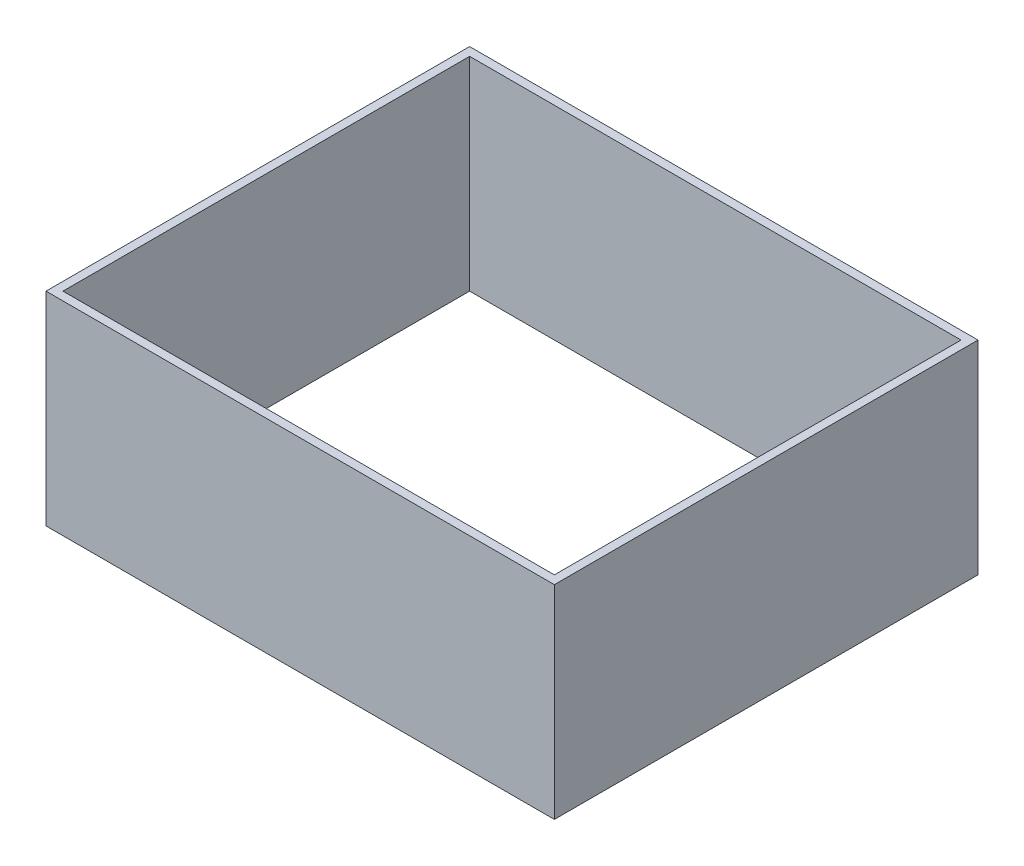
ISO-10303-21;
HEADER;
FILE_DESCRIPTION(('STEP AP214'),'2;1');
FILE_NAME('part.step','',(''),(''),'','','');
FILE_SCHEMA(('AUTOMOTIVE_DESIGN { 1 0 10303 214 1 1 1 1 }'));
ENDSEC;
DATA;
#1=APPLICATION_CONTEXT('core data for automotive mechanical design processes');
#2=APPLICATION_PROTOCOL_DEFINITION('international standard','automotive_design',2000,#1);
#3=PRODUCT_CONTEXT('',#1,'mechanical');
#4=PRODUCT('Part','Part','',(#3));
#5=PRODUCT_RELATED_PRODUCT_CATEGORY('part','',(#4));
#6=PRODUCT_DEFINITION_FORMATION('','',#4);
#7=PRODUCT_DEFINITION_CONTEXT('part definition',#1,'design');
#8=PRODUCT_DEFINITION('design','',#6,#7);
#9=PRODUCT_DEFINITION_SHAPE('','',#8);
#10=(LENGTH_UNIT() NAMED_UNIT(*) SI_UNIT(.MILLI.,.METRE.));
#11=(NAMED_UNIT(*) PLANE_ANGLE_UNIT() SI_UNIT($,.RADIAN.));
#12=(NAMED_UNIT(*) SI_UNIT($,.STERADIAN.) SOLID_ANGLE_UNIT());
#13=UNCERTAINTY_MEASURE_WITH_UNIT(LENGTH_MEASURE(1.E-05),#10,'distance_accuracy_value','');
#14=(GEOMETRIC_REPRESENTATION_CONTEXT(3) GLOBAL_UNCERTAINTY_ASSIGNED_CONTEXT((#13)) GLOBAL_UNIT_ASSIGNED_CONTEXT((#10,
#11,#12)) REPRESENTATION_CONTEXT('',''));
#15=CARTESIAN_POINT('',(0.,0.,0.));
#16=DIRECTION('',(0.,0.,1.));
#17=DIRECTION('',(1.,0.,0.));
#18=AXIS2_PLACEMENT_3D('',#15,#16,#17);
#19=CARTESIAN_POINT('',(0.,60.,0.));
#20=DIRECTION('',(0.,1.,0.));
#21=DIRECTION('',(0.,0.,1.));
#22=AXIS2_PLACEMENT_3D('',#19,#20,#21);
#23=PLANE('',#22);
#24=DIRECTION('',(0.,0.,-1.));
#25=VECTOR('',#24,1.);
#26=CARTESIAN_POINT('',(-75.,60.,0.));
#27=LINE('',#26,#25);
#28=CARTESIAN_POINT('',(-75.,60.,62.5));
#29=VERTEX_POINT('',#28);
#30=CARTESIAN_POINT('',(-75.,60.,-62.5));
#31=VERTEX_POINT('',#30);
#32=EDGE_CURVE('E136',#29,#31,#27,.T.);
#33=ORIENTED_EDGE('',*,*,#32,.F.);
#34=DIRECTION('',(1.,0.,0.));
#35=VECTOR('',#34,1.);
#36=CARTESIAN_POINT('',(0.,60.,62.5));
#37=LINE('',#36,#35);
#38=CARTESIAN_POINT('',(75.,60.,62.5));
#39=VERTEX_POINT('',#38);
#40=EDGE_CURVE('E139',#29,#39,#37,.T.);
#41=ORIENTED_EDGE('',*,*,#40,.T.);
#42=DIRECTION('',(0.,0.,-1.));
#43=VECTOR('',#42,1.);
#44=CARTESIAN_POINT('',(75.,60.,0.));
#45=LINE('',#44,#43);
#46=CARTESIAN_POINT('',(75.,60.,-62.5));
#47=VERTEX_POINT('',#46);
#48=EDGE_CURVE('E142',#39,#47,#45,.T.);
#49=ORIENTED_EDGE('',*,*,#48,.T.);
#50=DIRECTION('',(1.,0.,0.));
#51=VECTOR('',#50,1.);
#52=CARTESIAN_POINT('',(0.,60.,-62.5));
#53=LINE('',#52,#51);
#54=EDGE_CURVE('E144',#31,#47,#53,.T.);
#55=ORIENTED_EDGE('',*,*,#54,.F.);
#56=EDGE_LOOP('',(#33,#41,#49,#55));
#57=FACE_BOUND('',#56,.T.);
#58=DIRECTION('',(1.,0.,0.));
#59=VECTOR('',#58,1.);
#60=CARTESIAN_POINT('',(0.,60.,60.));
#61=LINE('',#60,#59);
#62=CARTESIAN_POINT('',(-72.5,60.,60.));
#63=VERTEX_POINT('',#62);
#64=CARTESIAN_POINT('',(72.5,60.,60.));
#65=VERTEX_POINT('',#64);
#66=EDGE_CURVE('E126',#63,#65,#61,.T.);
#67=ORIENTED_EDGE('',*,*,#66,.F.);
#68=DIRECTION('',(0.,0.,-1.));
#69=VECTOR('',#68,1.);
#70=CARTESIAN_POINT('',(-72.5,60.,0.));
#71=LINE('',#70,#69);
#72=CARTESIAN_POINT('',(-72.5,60.,-60.));
#73=VERTEX_POINT('',#72);
#74=EDGE_CURVE('E124',#63,#73,#71,.T.);
#75=ORIENTED_EDGE('',*,*,#74,.T.);
#76=DIRECTION('',(1.,0.,0.));
#77=VECTOR('',#76,1.);
#78=CARTESIAN_POINT('',(0.,60.,-60.));
#79=LINE('',#78,#77);
#80=CARTESIAN_POINT('',(72.5,60.,-60.));
#81=VERTEX_POINT('',#80);
#82=EDGE_CURVE('E109',#73,#81,#79,.T.);
#83=ORIENTED_EDGE('',*,*,#82,.T.);
#84=DIRECTION('',(0.,0.,-1.));
#85=VECTOR('',#84,1.);
#86=CARTESIAN_POINT('',(72.5,60.,0.));
#87=LINE('',#86,#85);
#88=EDGE_CURVE('E133',#65,#81,#87,.T.);
#89=ORIENTED_EDGE('',*,*,#88,.F.);
#90=EDGE_LOOP('',(#67,#75,#83,#89));
#91=FACE_BOUND('',#90,.T.);
#92=ADVANCED_FACE('F40',(#57,#91),#23,.T.);
#93=CARTESIAN_POINT('',(0.,0.,0.));
#94=DIRECTION('',(0.,1.,0.));
#95=DIRECTION('',(0.,0.,1.));
#96=AXIS2_PLACEMENT_3D('',#93,#94,#95);
#97=PLANE('',#96);
#98=DIRECTION('',(0.,0.,-1.));
#99=VECTOR('',#98,1.);
#100=CARTESIAN_POINT('',(-75.,0.,0.));
#101=LINE('',#100,#99);
#102=CARTESIAN_POINT('',(-75.,0.,62.5));
#103=VERTEX_POINT('',#102);
#104=CARTESIAN_POINT('',(-75.,0.,-62.5));
#105=VERTEX_POINT('',#104);
#106=EDGE_CURVE('E148',#103,#105,#101,.T.);
#107=ORIENTED_EDGE('',*,*,#106,.T.);
#108=DIRECTION('',(1.,0.,0.));
#109=VECTOR('',#108,1.);
#110=CARTESIAN_POINT('',(0.,0.,-62.5));
#111=LINE('',#110,#109);
#112=CARTESIAN_POINT('',(75.,0.,-62.5));
#113=VERTEX_POINT('',#112);
#114=EDGE_CURVE('E140',#105,#113,#111,.T.);
#115=ORIENTED_EDGE('',*,*,#114,.T.);
#116=DIRECTION('',(0.,0.,-1.));
#117=VECTOR('',#116,1.);
#118=CARTESIAN_POINT('',(75.,0.,0.));
#119=LINE('',#118,#117);
#120=CARTESIAN_POINT('',(75.,0.,62.5));
#121=VERTEX_POINT('',#120);
#122=EDGE_CURVE('E153',#121,#113,#119,.T.);
#123=ORIENTED_EDGE('',*,*,#122,.F.);
#124=DIRECTION('',(1.,0.,0.));
#125=VECTOR('',#124,1.);
#126=CARTESIAN_POINT('',(0.,0.,62.5));
#127=LINE('',#126,#125);
#128=EDGE_CURVE('E151',#103,#121,#127,.T.);
#129=ORIENTED_EDGE('',*,*,#128,.F.);
#130=EDGE_LOOP('',(#107,#115,#123,#129));
#131=FACE_BOUND('',#130,.T.);
#132=DIRECTION('',(0.,0.,-1.));
#133=VECTOR('',#132,1.);
#134=CARTESIAN_POINT('',(-72.5,0.,0.));
#135=LINE('',#134,#133);
#136=CARTESIAN_POINT('',(-72.5,0.,60.));
#137=VERTEX_POINT('',#136);
#138=CARTESIAN_POINT('',(-72.5,0.,-60.));
#139=VERTEX_POINT('',#138);
#140=EDGE_CURVE('E115',#137,#139,#135,.T.);
#141=ORIENTED_EDGE('',*,*,#140,.F.);
#142=DIRECTION('',(1.,0.,0.));
#143=VECTOR('',#142,1.);
#144=CARTESIAN_POINT('',(0.,0.,60.));
#145=LINE('',#144,#143);
#146=CARTESIAN_POINT('',(72.5,0.,60.));
#147=VERTEX_POINT('',#146);
#148=EDGE_CURVE('E121',#137,#147,#145,.T.);
#149=ORIENTED_EDGE('',*,*,#148,.T.);
#150=DIRECTION('',(0.,0.,-1.));
#151=VECTOR('',#150,1.);
#152=CARTESIAN_POINT('',(72.5,0.,0.));
#153=LINE('',#152,#151);
#154=CARTESIAN_POINT('',(72.5,0.,-60.));
#155=VERTEX_POINT('',#154);
#156=EDGE_CURVE('E62',#147,#155,#153,.T.);
#157=ORIENTED_EDGE('',*,*,#156,.T.);
#158=DIRECTION('',(1.,0.,0.));
#159=VECTOR('',#158,1.);
#160=CARTESIAN_POINT('',(0.,0.,-60.));
#161=LINE('',#160,#159);
#162=EDGE_CURVE('E107',#139,#155,#161,.T.);
#163=ORIENTED_EDGE('',*,*,#162,.F.);
#164=EDGE_LOOP('',(#141,#149,#157,#163));
#165=FACE_BOUND('',#164,.T.);
#166=ADVANCED_FACE('F123',(#131,#165),#97,.F.);
#167=CARTESIAN_POINT('',(-75.,60.,0.));
#168=DIRECTION('',(-1.,0.,0.));
#169=DIRECTION('',(0.,0.,1.));
#170=AXIS2_PLACEMENT_3D('',#167,#168,#169);
#171=PLANE('',#170);
#172=ORIENTED_EDGE('',*,*,#106,.F.);
#173=DIRECTION('',(0.,-1.,0.));
#174=VECTOR('',#173,1.);
#175=CARTESIAN_POINT('',(-75.,60.,62.5));
#176=LINE('',#175,#174);
#177=EDGE_CURVE('E11',#29,#103,#176,.T.);
#178=ORIENTED_EDGE('',*,*,#177,.F.);
#179=ORIENTED_EDGE('',*,*,#32,.T.);
#180=DIRECTION('',(0.,-1.,0.));
#181=VECTOR('',#180,1.);
#182=CARTESIAN_POINT('',(-75.,60.,-62.5));
#183=LINE('',#182,#181);
#184=EDGE_CURVE('E147',#31,#105,#183,.T.);
#185=ORIENTED_EDGE('',*,*,#184,.T.);
#186=EDGE_LOOP('',(#172,#178,#179,#185));
#187=FACE_BOUND('',#186,.T.);
#188=ADVANCED_FACE('F42',(#187),#171,.T.);
#189=CARTESIAN_POINT('',(0.,60.,62.5));
#190=DIRECTION('',(0.,0.,-1.));
#191=DIRECTION('',(-1.,0.,0.));
#192=AXIS2_PLACEMENT_3D('',#189,#190,#191);
#193=PLANE('',#192);
#194=ORIENTED_EDGE('',*,*,#128,.T.);
#195=DIRECTION('',(0.,-1.,0.));
#196=VECTOR('',#195,1.);
#197=CARTESIAN_POINT('',(75.,60.,62.5));
#198=LINE('',#197,#196);
#199=EDGE_CURVE('E48',#39,#121,#198,.T.);
#200=ORIENTED_EDGE('',*,*,#199,.F.);
#201=ORIENTED_EDGE('',*,*,#40,.F.);
#202=ORIENTED_EDGE('',*,*,#177,.T.);
#203=EDGE_LOOP('',(#194,#200,#201,#202));
#204=FACE_BOUND('',#203,.T.);
#205=ADVANCED_FACE('F179',(#204),#193,.F.);
#206=CARTESIAN_POINT('',(75.,60.,0.));
#207=DIRECTION('',(-1.,0.,0.));
#208=DIRECTION('',(0.,0.,1.));
#209=AXIS2_PLACEMENT_3D('',#206,#207,#208);
#210=PLANE('',#209);
#211=ORIENTED_EDGE('',*,*,#122,.T.);
#212=DIRECTION('',(0.,-1.,0.));
#213=VECTOR('',#212,1.);
#214=CARTESIAN_POINT('',(75.,60.,-62.5));
#215=LINE('',#214,#213);
#216=EDGE_CURVE('E159',#47,#113,#215,.T.);
#217=ORIENTED_EDGE('',*,*,#216,.F.);
#218=ORIENTED_EDGE('',*,*,#48,.F.);
#219=ORIENTED_EDGE('',*,*,#199,.T.);
#220=EDGE_LOOP('',(#211,#217,#218,#219));
#221=FACE_BOUND('',#220,.T.);
#222=ADVANCED_FACE('F165',(#221),#210,.F.);
#223=CARTESIAN_POINT('',(0.,60.,-62.5));
#224=DIRECTION('',(0.,0.,-1.));
#225=DIRECTION('',(-1.,0.,0.));
#226=AXIS2_PLACEMENT_3D('',#223,#224,#225);
#227=PLANE('',#226);
#228=ORIENTED_EDGE('',*,*,#114,.F.);
#229=ORIENTED_EDGE('',*,*,#184,.F.);
#230=ORIENTED_EDGE('',*,*,#54,.T.);
#231=ORIENTED_EDGE('',*,*,#216,.T.);
#232=EDGE_LOOP('',(#228,#229,#230,#231));
#233=FACE_BOUND('',#232,.T.);
#234=ADVANCED_FACE('F174',(#233),#227,.T.);
#235=CARTESIAN_POINT('',(-72.5,60.,0.));
#236=DIRECTION('',(-1.,0.,0.));
#237=DIRECTION('',(0.,0.,1.));
#238=AXIS2_PLACEMENT_3D('',#235,#236,#237);
#239=PLANE('',#238);
#240=ORIENTED_EDGE('',*,*,#140,.T.);
#241=DIRECTION('',(0.,-1.,0.));
#242=VECTOR('',#241,1.);
#243=CARTESIAN_POINT('',(-72.5,60.,-60.));
#244=LINE('',#243,#242);
#245=EDGE_CURVE('E103',#73,#139,#244,.T.);
#246=ORIENTED_EDGE('',*,*,#245,.F.);
#247=ORIENTED_EDGE('',*,*,#74,.F.);
#248=DIRECTION('',(0.,-1.,0.));
#249=VECTOR('',#248,1.);
#250=CARTESIAN_POINT('',(-72.5,60.,60.));
#251=LINE('',#250,#249);
#252=EDGE_CURVE('E117',#63,#137,#251,.T.);
#253=ORIENTED_EDGE('',*,*,#252,.T.);
#254=EDGE_LOOP('',(#240,#246,#247,#253));
#255=FACE_BOUND('',#254,.T.);
#256=ADVANCED_FACE('F116',(#255),#239,.F.);
#257=CARTESIAN_POINT('',(0.,60.,60.));
#258=DIRECTION('',(0.,0.,-1.));
#259=DIRECTION('',(-1.,0.,0.));
#260=AXIS2_PLACEMENT_3D('',#257,#258,#259);
#261=PLANE('',#260);
#262=ORIENTED_EDGE('',*,*,#148,.F.);
#263=ORIENTED_EDGE('',*,*,#252,.F.);
#264=ORIENTED_EDGE('',*,*,#66,.T.);
#265=DIRECTION('',(0.,-1.,0.));
#266=VECTOR('',#265,1.);
#267=CARTESIAN_POINT('',(72.5,60.,60.));
#268=LINE('',#267,#266);
#269=EDGE_CURVE('E274',#65,#147,#268,.T.);
#270=ORIENTED_EDGE('',*,*,#269,.T.);
#271=EDGE_LOOP('',(#262,#263,#264,#270));
#272=FACE_BOUND('',#271,.T.);
#273=ADVANCED_FACE('F211',(#272),#261,.T.);
#274=CARTESIAN_POINT('',(72.5,60.,0.));
#275=DIRECTION('',(-1.,0.,0.));
#276=DIRECTION('',(0.,0.,1.));
#277=AXIS2_PLACEMENT_3D('',#274,#275,#276);
#278=PLANE('',#277);
#279=ORIENTED_EDGE('',*,*,#156,.F.);
#280=ORIENTED_EDGE('',*,*,#269,.F.);
#281=ORIENTED_EDGE('',*,*,#88,.T.);
#282=DIRECTION('',(0.,-1.,0.));
#283=VECTOR('',#282,1.);
#284=CARTESIAN_POINT('',(72.5,60.,-60.));
#285=LINE('',#284,#283);
#286=EDGE_CURVE('E55',#81,#155,#285,.T.);
#287=ORIENTED_EDGE('',*,*,#286,.T.);
#288=EDGE_LOOP('',(#279,#280,#281,#287));
#289=FACE_BOUND('',#288,.T.);
#290=ADVANCED_FACE('F219',(#289),#278,.T.);
#291=CARTESIAN_POINT('',(0.,60.,-60.));
#292=DIRECTION('',(0.,0.,-1.));
#293=DIRECTION('',(-1.,0.,0.));
#294=AXIS2_PLACEMENT_3D('',#291,#292,#293);
#295=PLANE('',#294);
#296=ORIENTED_EDGE('',*,*,#162,.T.);
#297=ORIENTED_EDGE('',*,*,#286,.F.);
#298=ORIENTED_EDGE('',*,*,#82,.F.);
#299=ORIENTED_EDGE('',*,*,#245,.T.);
#300=EDGE_LOOP('',(#296,#297,#298,#299));
#301=FACE_BOUND('',#300,.T.);
#302=ADVANCED_FACE('F105',(#301),#295,.F.);
#303=CLOSED_SHELL('',(#92,#166,#188,#205,#222,#234,#256,#273,#290,#302));
#304=MANIFOLD_SOLID_BREP('B2',#303);
#305=ADVANCED_BREP_SHAPE_REPRESENTATION('',(#18,#304),#14);
#306=SHAPE_DEFINITION_REPRESENTATION(#9,#305);
ENDSEC;
END-ISO-10303-21;
